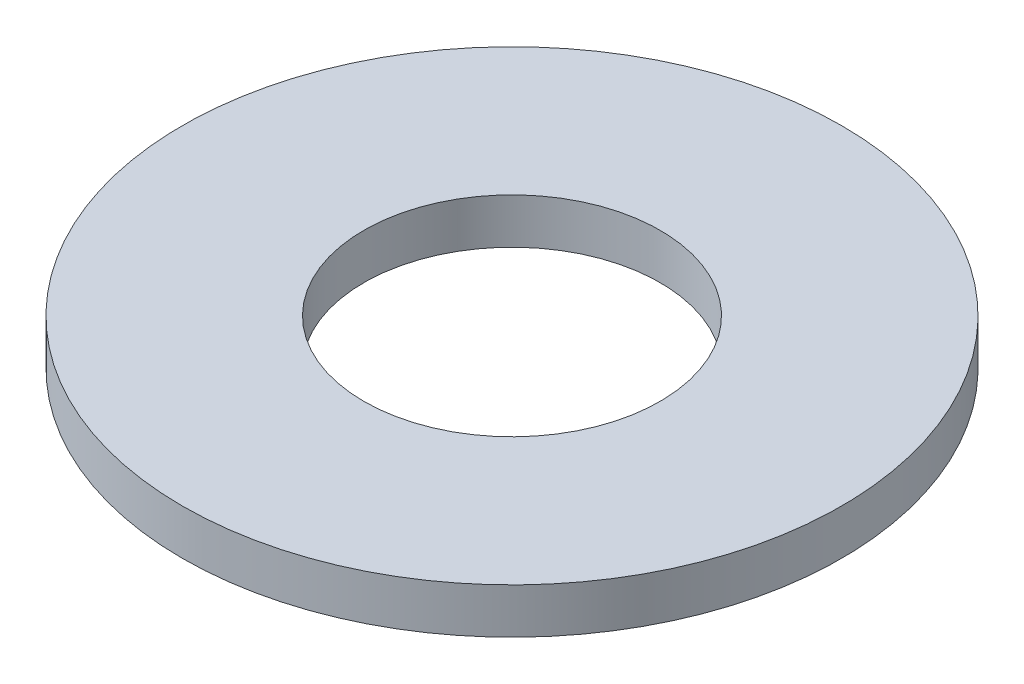
ISO-10303-21;
HEADER;
FILE_DESCRIPTION(('STEP AP214'),'2;1');
FILE_NAME('part.step','',(''),(''),'','','');
FILE_SCHEMA(('AUTOMOTIVE_DESIGN { 1 0 10303 214 1 1 1 1 }'));
ENDSEC;
DATA;
#1=APPLICATION_CONTEXT('core data for automotive mechanical design processes');
#2=APPLICATION_PROTOCOL_DEFINITION('international standard','automotive_design',2000,#1);
#3=PRODUCT_CONTEXT('',#1,'mechanical');
#4=PRODUCT('Part','Part','',(#3));
#5=PRODUCT_RELATED_PRODUCT_CATEGORY('part','',(#4));
#6=PRODUCT_DEFINITION_FORMATION('','',#4);
#7=PRODUCT_DEFINITION_CONTEXT('part definition',#1,'design');
#8=PRODUCT_DEFINITION('design','',#6,#7);
#9=PRODUCT_DEFINITION_SHAPE('','',#8);
#10=(LENGTH_UNIT() NAMED_UNIT(*) SI_UNIT(.MILLI.,.METRE.));
#11=(NAMED_UNIT(*) PLANE_ANGLE_UNIT() SI_UNIT($,.RADIAN.));
#12=(NAMED_UNIT(*) SI_UNIT($,.STERADIAN.) SOLID_ANGLE_UNIT());
#13=UNCERTAINTY_MEASURE_WITH_UNIT(LENGTH_MEASURE(1.E-05),#10,'distance_accuracy_value','');
#14=(GEOMETRIC_REPRESENTATION_CONTEXT(3) GLOBAL_UNCERTAINTY_ASSIGNED_CONTEXT((#13)) GLOBAL_UNIT_ASSIGNED_CONTEXT((#10,
#11,#12)) REPRESENTATION_CONTEXT('',''));
#15=CARTESIAN_POINT('',(0.,0.,0.));
#16=DIRECTION('',(0.,0.,1.));
#17=DIRECTION('',(1.,0.,0.));
#18=AXIS2_PLACEMENT_3D('',#15,#16,#17);
#19=CARTESIAN_POINT('',(0.,1.0922,0.));
#20=DIRECTION('',(0.,-1.,0.));
#21=DIRECTION('',(0.,0.,-1.));
#22=AXIS2_PLACEMENT_3D('',#19,#20,#21);
#23=CYLINDRICAL_SURFACE('',#22,7.9375);
#24=CARTESIAN_POINT('',(0.,1.0922,0.));
#25=DIRECTION('',(0.,1.,0.));
#26=DIRECTION('',(0.,0.,1.));
#27=AXIS2_PLACEMENT_3D('',#24,#25,#26);
#28=CIRCLE('',#27,7.9375);
#29=CARTESIAN_POINT('',(0.,1.0922,7.9375));
#30=VERTEX_POINT('',#29);
#31=EDGE_CURVE('E10',#30,#30,#28,.T.);
#32=ORIENTED_EDGE('',*,*,#31,.F.);
#33=EDGE_LOOP('',(#32));
#34=FACE_BOUND('',#33,.T.);
#35=CARTESIAN_POINT('',(0.,0.,0.));
#36=DIRECTION('',(0.,1.,0.));
#37=DIRECTION('',(0.,0.,1.));
#38=AXIS2_PLACEMENT_3D('',#35,#36,#37);
#39=CIRCLE('',#38,7.9375);
#40=CARTESIAN_POINT('',(0.,0.,7.9375));
#41=VERTEX_POINT('',#40);
#42=EDGE_CURVE('E36',#41,#41,#39,.T.);
#43=ORIENTED_EDGE('',*,*,#42,.T.);
#44=EDGE_LOOP('',(#43));
#45=FACE_BOUND('',#44,.T.);
#46=ADVANCED_FACE('F33',(#34,#45),#23,.T.);
#47=CARTESIAN_POINT('',(0.,1.0922,0.));
#48=DIRECTION('',(0.,1.,0.));
#49=DIRECTION('',(0.,0.,1.));
#50=AXIS2_PLACEMENT_3D('',#47,#48,#49);
#51=PLANE('',#50);
#52=CARTESIAN_POINT('',(0.,1.0922,0.));
#53=DIRECTION('',(0.,1.,0.));
#54=DIRECTION('',(0.,0.,1.));
#55=AXIS2_PLACEMENT_3D('',#52,#53,#54);
#56=CIRCLE('',#55,3.5687);
#57=CARTESIAN_POINT('',(0.,1.0922,3.5687));
#58=VERTEX_POINT('',#57);
#59=EDGE_CURVE('E45',#58,#58,#56,.T.);
#60=ORIENTED_EDGE('',*,*,#59,.F.);
#61=EDGE_LOOP('',(#60));
#62=FACE_BOUND('',#61,.T.);
#63=ORIENTED_EDGE('',*,*,#31,.T.);
#64=EDGE_LOOP('',(#63));
#65=FACE_BOUND('',#64,.T.);
#66=ADVANCED_FACE('F60',(#62,#65),#51,.T.);
#67=CARTESIAN_POINT('',(0.,0.,0.));
#68=DIRECTION('',(0.,1.,0.));
#69=DIRECTION('',(0.,0.,1.));
#70=AXIS2_PLACEMENT_3D('',#67,#68,#69);
#71=PLANE('',#70);
#72=CARTESIAN_POINT('',(0.,0.,0.));
#73=DIRECTION('',(0.,1.,0.));
#74=DIRECTION('',(0.,0.,1.));
#75=AXIS2_PLACEMENT_3D('',#72,#73,#74);
#76=CIRCLE('',#75,3.5687);
#77=CARTESIAN_POINT('',(0.,0.,3.5687));
#78=VERTEX_POINT('',#77);
#79=EDGE_CURVE('E43',#78,#78,#76,.T.);
#80=ORIENTED_EDGE('',*,*,#79,.T.);
#81=EDGE_LOOP('',(#80));
#82=FACE_BOUND('',#81,.T.);
#83=ORIENTED_EDGE('',*,*,#42,.F.);
#84=EDGE_LOOP('',(#83));
#85=FACE_BOUND('',#84,.T.);
#86=ADVANCED_FACE('F51',(#82,#85),#71,.F.);
#87=CARTESIAN_POINT('',(0.,0.,0.));
#88=DIRECTION('',(0.,1.,0.));
#89=DIRECTION('',(0.,0.,1.));
#90=AXIS2_PLACEMENT_3D('',#87,#88,#89);
#91=CYLINDRICAL_SURFACE('',#90,3.5687);
#92=ORIENTED_EDGE('',*,*,#79,.F.);
#93=EDGE_LOOP('',(#92));
#94=FACE_BOUND('',#93,.T.);
#95=ORIENTED_EDGE('',*,*,#59,.T.);
#96=EDGE_LOOP('',(#95));
#97=FACE_BOUND('',#96,.T.);
#98=ADVANCED_FACE('F54',(#94,#97),#91,.F.);
#99=CLOSED_SHELL('',(#46,#66,#86,#98));
#100=MANIFOLD_SOLID_BREP('B2',#99);
#101=ADVANCED_BREP_SHAPE_REPRESENTATION('',(#18,#100),#14);
#102=SHAPE_DEFINITION_REPRESENTATION(#9,#101);
ENDSEC;
END-ISO-10303-21;
